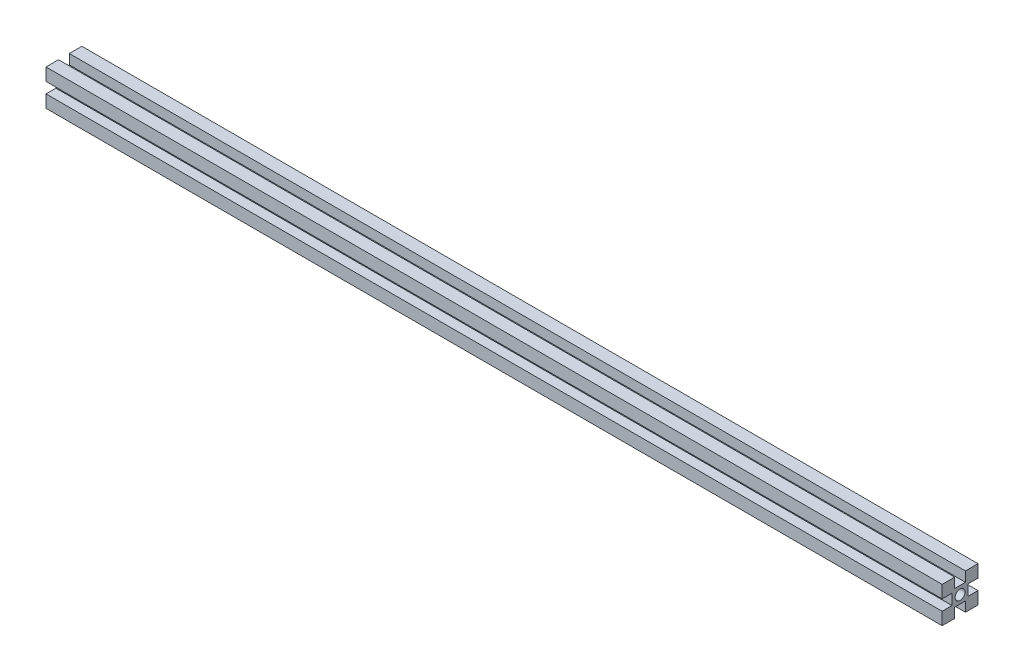
ISO-10303-21;
HEADER;
FILE_DESCRIPTION(('STEP AP214'),'2;1');
FILE_NAME('part.step','',(''),(''),'','','');
FILE_SCHEMA(('AUTOMOTIVE_DESIGN { 1 0 10303 214 1 1 1 1 }'));
ENDSEC;
DATA;
#1=APPLICATION_CONTEXT('core data for automotive mechanical design processes');
#2=APPLICATION_PROTOCOL_DEFINITION('international standard','automotive_design',2000,#1);
#3=PRODUCT_CONTEXT('',#1,'mechanical');
#4=PRODUCT('Part','Part','',(#3));
#5=PRODUCT_RELATED_PRODUCT_CATEGORY('part','',(#4));
#6=PRODUCT_DEFINITION_FORMATION('','',#4);
#7=PRODUCT_DEFINITION_CONTEXT('part definition',#1,'design');
#8=PRODUCT_DEFINITION('design','',#6,#7);
#9=PRODUCT_DEFINITION_SHAPE('','',#8);
#10=(LENGTH_UNIT() NAMED_UNIT(*) SI_UNIT(.MILLI.,.METRE.));
#11=(NAMED_UNIT(*) PLANE_ANGLE_UNIT() SI_UNIT($,.RADIAN.));
#12=(NAMED_UNIT(*) SI_UNIT($,.STERADIAN.) SOLID_ANGLE_UNIT());
#13=UNCERTAINTY_MEASURE_WITH_UNIT(LENGTH_MEASURE(1.E-05),#10,'distance_accuracy_value','');
#14=(GEOMETRIC_REPRESENTATION_CONTEXT(3) GLOBAL_UNCERTAINTY_ASSIGNED_CONTEXT((#13)) GLOBAL_UNIT_ASSIGNED_CONTEXT((#10,
#11,#12)) REPRESENTATION_CONTEXT('',''));
#15=CARTESIAN_POINT('',(0.,0.,0.));
#16=DIRECTION('',(0.,0.,1.));
#17=DIRECTION('',(1.,0.,0.));
#18=AXIS2_PLACEMENT_3D('',#15,#16,#17);
#19=CARTESIAN_POINT('',(500.,10.,-9.99999999999997));
#20=DIRECTION('',(0.,0.,-1.));
#21=DIRECTION('',(-1.,0.,0.));
#22=AXIS2_PLACEMENT_3D('',#19,#20,#21);
#23=PLANE('',#22);
#24=DIRECTION('',(0.,-1.,0.));
#25=VECTOR('',#24,1.);
#26=CARTESIAN_POINT('',(0.,10.,-10.));
#27=LINE('',#26,#25);
#28=CARTESIAN_POINT('',(0.,10.,-10.));
#29=VERTEX_POINT('',#28);
#30=CARTESIAN_POINT('',(0.,3.,-10.));
#31=VERTEX_POINT('',#30);
#32=EDGE_CURVE('E202',#29,#31,#27,.T.);
#33=ORIENTED_EDGE('',*,*,#32,.F.);
#34=DIRECTION('',(-1.,0.,0.));
#35=VECTOR('',#34,1.);
#36=CARTESIAN_POINT('',(500.,10.,-9.99999999999997));
#37=LINE('',#36,#35);
#38=CARTESIAN_POINT('',(500.,10.,-9.99999999999997));
#39=VERTEX_POINT('',#38);
#40=EDGE_CURVE('E11',#39,#29,#37,.T.);
#41=ORIENTED_EDGE('',*,*,#40,.F.);
#42=DIRECTION('',(0.,-1.,0.));
#43=VECTOR('',#42,1.);
#44=CARTESIAN_POINT('',(500.,10.,-9.99999999999997));
#45=LINE('',#44,#43);
#46=CARTESIAN_POINT('',(500.,3.,-9.99999999999997));
#47=VERTEX_POINT('',#46);
#48=EDGE_CURVE('E259',#39,#47,#45,.T.);
#49=ORIENTED_EDGE('',*,*,#48,.T.);
#50=DIRECTION('',(-1.,0.,0.));
#51=VECTOR('',#50,1.);
#52=CARTESIAN_POINT('',(500.,3.,-9.99999999999997));
#53=LINE('',#52,#51);
#54=EDGE_CURVE('E36',#47,#31,#53,.T.);
#55=ORIENTED_EDGE('',*,*,#54,.T.);
#56=EDGE_LOOP('',(#33,#41,#49,#55));
#57=FACE_BOUND('',#56,.T.);
#58=ADVANCED_FACE('F33',(#57),#23,.T.);
#59=CARTESIAN_POINT('',(500.,10.,-2.99999999999997));
#60=DIRECTION('',(0.,1.,0.));
#61=DIRECTION('',(0.,0.,1.));
#62=AXIS2_PLACEMENT_3D('',#59,#60,#61);
#63=PLANE('',#62);
#64=DIRECTION('',(0.,0.,-1.));
#65=VECTOR('',#64,1.);
#66=CARTESIAN_POINT('',(0.,10.,-3.));
#67=LINE('',#66,#65);
#68=CARTESIAN_POINT('',(0.,10.,-3.));
#69=VERTEX_POINT('',#68);
#70=EDGE_CURVE('E257',#69,#29,#67,.T.);
#71=ORIENTED_EDGE('',*,*,#70,.F.);
#72=DIRECTION('',(-1.,0.,0.));
#73=VECTOR('',#72,1.);
#74=CARTESIAN_POINT('',(500.,10.,-2.99999999999997));
#75=LINE('',#74,#73);
#76=CARTESIAN_POINT('',(500.,10.,-2.99999999999997));
#77=VERTEX_POINT('',#76);
#78=EDGE_CURVE('E42',#77,#69,#75,.T.);
#79=ORIENTED_EDGE('',*,*,#78,.F.);
#80=DIRECTION('',(0.,0.,-1.));
#81=VECTOR('',#80,1.);
#82=CARTESIAN_POINT('',(500.,10.,-2.99999999999997));
#83=LINE('',#82,#81);
#84=EDGE_CURVE('E192',#77,#39,#83,.T.);
#85=ORIENTED_EDGE('',*,*,#84,.T.);
#86=ORIENTED_EDGE('',*,*,#40,.T.);
#87=EDGE_LOOP('',(#71,#79,#85,#86));
#88=FACE_BOUND('',#87,.T.);
#89=ADVANCED_FACE('F295',(#88),#63,.T.);
#90=CARTESIAN_POINT('',(500.,4.5,-2.99999999999997));
#91=DIRECTION('',(0.,0.,1.));
#92=DIRECTION('',(1.,0.,0.));
#93=AXIS2_PLACEMENT_3D('',#90,#91,#92);
#94=PLANE('',#93);
#95=DIRECTION('',(0.,1.,0.));
#96=VECTOR('',#95,1.);
#97=CARTESIAN_POINT('',(0.,4.5,-3.));
#98=LINE('',#97,#96);
#99=CARTESIAN_POINT('',(0.,4.5,-3.));
#100=VERTEX_POINT('',#99);
#101=EDGE_CURVE('E179',#100,#69,#98,.T.);
#102=ORIENTED_EDGE('',*,*,#101,.F.);
#103=DIRECTION('',(-1.,0.,0.));
#104=VECTOR('',#103,1.);
#105=CARTESIAN_POINT('',(500.,4.5,-2.99999999999997));
#106=LINE('',#105,#104);
#107=CARTESIAN_POINT('',(500.,4.5,-2.99999999999997));
#108=VERTEX_POINT('',#107);
#109=EDGE_CURVE('E174',#108,#100,#106,.T.);
#110=ORIENTED_EDGE('',*,*,#109,.F.);
#111=DIRECTION('',(0.,1.,0.));
#112=VECTOR('',#111,1.);
#113=CARTESIAN_POINT('',(500.,4.5,-2.99999999999997));
#114=LINE('',#113,#112);
#115=EDGE_CURVE('E177',#108,#77,#114,.T.);
#116=ORIENTED_EDGE('',*,*,#115,.T.);
#117=ORIENTED_EDGE('',*,*,#78,.T.);
#118=EDGE_LOOP('',(#102,#110,#116,#117));
#119=FACE_BOUND('',#118,.T.);
#120=ADVANCED_FACE('F176',(#119),#94,.T.);
#121=CARTESIAN_POINT('',(500.,4.5,3.00000000000003));
#122=DIRECTION('',(0.,1.,0.));
#123=DIRECTION('',(0.,0.,1.));
#124=AXIS2_PLACEMENT_3D('',#121,#122,#123);
#125=PLANE('',#124);
#126=DIRECTION('',(0.,0.,-1.));
#127=VECTOR('',#126,1.);
#128=CARTESIAN_POINT('',(0.,4.5,3.));
#129=LINE('',#128,#127);
#130=CARTESIAN_POINT('',(0.,4.5,3.));
#131=VERTEX_POINT('',#130);
#132=EDGE_CURVE('E254',#131,#100,#129,.T.);
#133=ORIENTED_EDGE('',*,*,#132,.F.);
#134=DIRECTION('',(-1.,0.,0.));
#135=VECTOR('',#134,1.);
#136=CARTESIAN_POINT('',(500.,4.5,3.00000000000003));
#137=LINE('',#136,#135);
#138=CARTESIAN_POINT('',(500.,4.5,3.00000000000003));
#139=VERTEX_POINT('',#138);
#140=EDGE_CURVE('E184',#139,#131,#137,.T.);
#141=ORIENTED_EDGE('',*,*,#140,.F.);
#142=DIRECTION('',(0.,0.,-1.));
#143=VECTOR('',#142,1.);
#144=CARTESIAN_POINT('',(500.,4.5,3.00000000000003));
#145=LINE('',#144,#143);
#146=EDGE_CURVE('E190',#139,#108,#145,.T.);
#147=ORIENTED_EDGE('',*,*,#146,.T.);
#148=ORIENTED_EDGE('',*,*,#109,.T.);
#149=EDGE_LOOP('',(#133,#141,#147,#148));
#150=FACE_BOUND('',#149,.T.);
#151=ADVANCED_FACE('F194',(#150),#125,.T.);
#152=CARTESIAN_POINT('',(500.,10.,3.00000000000003));
#153=DIRECTION('',(0.,0.,-1.));
#154=DIRECTION('',(-1.,0.,0.));
#155=AXIS2_PLACEMENT_3D('',#152,#153,#154);
#156=PLANE('',#155);
#157=DIRECTION('',(0.,-1.,0.));
#158=VECTOR('',#157,1.);
#159=CARTESIAN_POINT('',(0.,10.,3.));
#160=LINE('',#159,#158);
#161=CARTESIAN_POINT('',(0.,10.,3.));
#162=VERTEX_POINT('',#161);
#163=EDGE_CURVE('E251',#162,#131,#160,.T.);
#164=ORIENTED_EDGE('',*,*,#163,.F.);
#165=DIRECTION('',(-1.,0.,0.));
#166=VECTOR('',#165,1.);
#167=CARTESIAN_POINT('',(500.,10.,3.00000000000003));
#168=LINE('',#167,#166);
#169=CARTESIAN_POINT('',(500.,10.,3.00000000000003));
#170=VERTEX_POINT('',#169);
#171=EDGE_CURVE('E263',#170,#162,#168,.T.);
#172=ORIENTED_EDGE('',*,*,#171,.F.);
#173=DIRECTION('',(0.,-1.,0.));
#174=VECTOR('',#173,1.);
#175=CARTESIAN_POINT('',(500.,10.,3.00000000000003));
#176=LINE('',#175,#174);
#177=EDGE_CURVE('E195',#170,#139,#176,.T.);
#178=ORIENTED_EDGE('',*,*,#177,.T.);
#179=ORIENTED_EDGE('',*,*,#140,.T.);
#180=EDGE_LOOP('',(#164,#172,#178,#179));
#181=FACE_BOUND('',#180,.T.);
#182=ADVANCED_FACE('F308',(#181),#156,.T.);
#183=CARTESIAN_POINT('',(500.,10.,10.));
#184=DIRECTION('',(0.,1.,0.));
#185=DIRECTION('',(0.,0.,1.));
#186=AXIS2_PLACEMENT_3D('',#183,#184,#185);
#187=PLANE('',#186);
#188=DIRECTION('',(0.,0.,-1.));
#189=VECTOR('',#188,1.);
#190=CARTESIAN_POINT('',(0.,10.,10.));
#191=LINE('',#190,#189);
#192=CARTESIAN_POINT('',(0.,10.,10.));
#193=VERTEX_POINT('',#192);
#194=EDGE_CURVE('E248',#193,#162,#191,.T.);
#195=ORIENTED_EDGE('',*,*,#194,.F.);
#196=DIRECTION('',(-1.,0.,0.));
#197=VECTOR('',#196,1.);
#198=CARTESIAN_POINT('',(500.,10.,10.));
#199=LINE('',#198,#197);
#200=CARTESIAN_POINT('',(500.,10.,10.));
#201=VERTEX_POINT('',#200);
#202=EDGE_CURVE('E265',#201,#193,#199,.T.);
#203=ORIENTED_EDGE('',*,*,#202,.F.);
#204=DIRECTION('',(0.,0.,-1.));
#205=VECTOR('',#204,1.);
#206=CARTESIAN_POINT('',(500.,10.,10.));
#207=LINE('',#206,#205);
#208=EDGE_CURVE('E197',#201,#170,#207,.T.);
#209=ORIENTED_EDGE('',*,*,#208,.T.);
#210=ORIENTED_EDGE('',*,*,#171,.T.);
#211=EDGE_LOOP('',(#195,#203,#209,#210));
#212=FACE_BOUND('',#211,.T.);
#213=ADVANCED_FACE('F311',(#212),#187,.T.);
#214=CARTESIAN_POINT('',(500.,3.,10.));
#215=DIRECTION('',(0.,0.,1.));
#216=DIRECTION('',(1.,0.,0.));
#217=AXIS2_PLACEMENT_3D('',#214,#215,#216);
#218=PLANE('',#217);
#219=DIRECTION('',(0.,1.,0.));
#220=VECTOR('',#219,1.);
#221=CARTESIAN_POINT('',(0.,3.,10.));
#222=LINE('',#221,#220);
#223=CARTESIAN_POINT('',(0.,3.,10.));
#224=VERTEX_POINT('',#223);
#225=EDGE_CURVE('E245',#224,#193,#222,.T.);
#226=ORIENTED_EDGE('',*,*,#225,.F.);
#227=DIRECTION('',(-1.,0.,0.));
#228=VECTOR('',#227,1.);
#229=CARTESIAN_POINT('',(500.,3.,10.));
#230=LINE('',#229,#228);
#231=CARTESIAN_POINT('',(500.,3.,10.));
#232=VERTEX_POINT('',#231);
#233=EDGE_CURVE('E267',#232,#224,#230,.T.);
#234=ORIENTED_EDGE('',*,*,#233,.F.);
#235=DIRECTION('',(0.,1.,0.));
#236=VECTOR('',#235,1.);
#237=CARTESIAN_POINT('',(500.,3.,10.));
#238=LINE('',#237,#236);
#239=EDGE_CURVE('E430',#232,#201,#238,.T.);
#240=ORIENTED_EDGE('',*,*,#239,.T.);
#241=ORIENTED_EDGE('',*,*,#202,.T.);
#242=EDGE_LOOP('',(#226,#234,#240,#241));
#243=FACE_BOUND('',#242,.T.);
#244=ADVANCED_FACE('F315',(#243),#218,.T.);
#245=CARTESIAN_POINT('',(500.,3.,4.50000000000003));
#246=DIRECTION('',(0.,-1.,0.));
#247=DIRECTION('',(0.,0.,-1.));
#248=AXIS2_PLACEMENT_3D('',#245,#246,#247);
#249=PLANE('',#248);
#250=DIRECTION('',(0.,0.,1.));
#251=VECTOR('',#250,1.);
#252=CARTESIAN_POINT('',(0.,3.,4.5));
#253=LINE('',#252,#251);
#254=CARTESIAN_POINT('',(0.,3.,4.5));
#255=VERTEX_POINT('',#254);
#256=EDGE_CURVE('E242',#255,#224,#253,.T.);
#257=ORIENTED_EDGE('',*,*,#256,.F.);
#258=DIRECTION('',(-1.,0.,0.));
#259=VECTOR('',#258,1.);
#260=CARTESIAN_POINT('',(500.,3.,4.50000000000003));
#261=LINE('',#260,#259);
#262=CARTESIAN_POINT('',(500.,3.,4.50000000000003));
#263=VERTEX_POINT('',#262);
#264=EDGE_CURVE('E269',#263,#255,#261,.T.);
#265=ORIENTED_EDGE('',*,*,#264,.F.);
#266=DIRECTION('',(0.,0.,1.));
#267=VECTOR('',#266,1.);
#268=CARTESIAN_POINT('',(500.,3.,4.50000000000003));
#269=LINE('',#268,#267);
#270=EDGE_CURVE('E427',#263,#232,#269,.T.);
#271=ORIENTED_EDGE('',*,*,#270,.T.);
#272=ORIENTED_EDGE('',*,*,#233,.T.);
#273=EDGE_LOOP('',(#257,#265,#271,#272));
#274=FACE_BOUND('',#273,.T.);
#275=ADVANCED_FACE('F319',(#274),#249,.T.);
#276=CARTESIAN_POINT('',(500.,-3.,4.50000000000003));
#277=DIRECTION('',(0.,0.,1.));
#278=DIRECTION('',(1.,0.,0.));
#279=AXIS2_PLACEMENT_3D('',#276,#277,#278);
#280=PLANE('',#279);
#281=DIRECTION('',(0.,1.,0.));
#282=VECTOR('',#281,1.);
#283=CARTESIAN_POINT('',(0.,-3.,4.5));
#284=LINE('',#283,#282);
#285=CARTESIAN_POINT('',(0.,-3.,4.5));
#286=VERTEX_POINT('',#285);
#287=EDGE_CURVE('E239',#286,#255,#284,.T.);
#288=ORIENTED_EDGE('',*,*,#287,.F.);
#289=DIRECTION('',(-1.,0.,0.));
#290=VECTOR('',#289,1.);
#291=CARTESIAN_POINT('',(500.,-3.,4.50000000000003));
#292=LINE('',#291,#290);
#293=CARTESIAN_POINT('',(500.,-3.,4.50000000000003));
#294=VERTEX_POINT('',#293);
#295=EDGE_CURVE('E271',#294,#286,#292,.T.);
#296=ORIENTED_EDGE('',*,*,#295,.F.);
#297=DIRECTION('',(0.,1.,0.));
#298=VECTOR('',#297,1.);
#299=CARTESIAN_POINT('',(500.,-3.,4.50000000000003));
#300=LINE('',#299,#298);
#301=EDGE_CURVE('E424',#294,#263,#300,.T.);
#302=ORIENTED_EDGE('',*,*,#301,.T.);
#303=ORIENTED_EDGE('',*,*,#264,.T.);
#304=EDGE_LOOP('',(#288,#296,#302,#303));
#305=FACE_BOUND('',#304,.T.);
#306=ADVANCED_FACE('F323',(#305),#280,.T.);
#307=CARTESIAN_POINT('',(500.,-3.,10.));
#308=DIRECTION('',(0.,1.,0.));
#309=DIRECTION('',(0.,0.,1.));
#310=AXIS2_PLACEMENT_3D('',#307,#308,#309);
#311=PLANE('',#310);
#312=DIRECTION('',(0.,0.,-1.));
#313=VECTOR('',#312,1.);
#314=CARTESIAN_POINT('',(0.,-3.,10.));
#315=LINE('',#314,#313);
#316=CARTESIAN_POINT('',(0.,-3.,10.));
#317=VERTEX_POINT('',#316);
#318=EDGE_CURVE('E236',#317,#286,#315,.T.);
#319=ORIENTED_EDGE('',*,*,#318,.F.);
#320=DIRECTION('',(-1.,0.,0.));
#321=VECTOR('',#320,1.);
#322=CARTESIAN_POINT('',(500.,-3.,10.));
#323=LINE('',#322,#321);
#324=CARTESIAN_POINT('',(500.,-3.,10.));
#325=VERTEX_POINT('',#324);
#326=EDGE_CURVE('E273',#325,#317,#323,.T.);
#327=ORIENTED_EDGE('',*,*,#326,.F.);
#328=DIRECTION('',(0.,0.,-1.));
#329=VECTOR('',#328,1.);
#330=CARTESIAN_POINT('',(500.,-3.,10.));
#331=LINE('',#330,#329);
#332=EDGE_CURVE('E421',#325,#294,#331,.T.);
#333=ORIENTED_EDGE('',*,*,#332,.T.);
#334=ORIENTED_EDGE('',*,*,#295,.T.);
#335=EDGE_LOOP('',(#319,#327,#333,#334));
#336=FACE_BOUND('',#335,.T.);
#337=ADVANCED_FACE('F327',(#336),#311,.T.);
#338=CARTESIAN_POINT('',(500.,-10.,10.));
#339=DIRECTION('',(0.,0.,1.));
#340=DIRECTION('',(1.,0.,0.));
#341=AXIS2_PLACEMENT_3D('',#338,#339,#340);
#342=PLANE('',#341);
#343=DIRECTION('',(0.,1.,0.));
#344=VECTOR('',#343,1.);
#345=CARTESIAN_POINT('',(0.,-10.,10.));
#346=LINE('',#345,#344);
#347=CARTESIAN_POINT('',(0.,-10.,10.));
#348=VERTEX_POINT('',#347);
#349=EDGE_CURVE('E233',#348,#317,#346,.T.);
#350=ORIENTED_EDGE('',*,*,#349,.F.);
#351=DIRECTION('',(-1.,0.,0.));
#352=VECTOR('',#351,1.);
#353=CARTESIAN_POINT('',(500.,-10.,10.));
#354=LINE('',#353,#352);
#355=CARTESIAN_POINT('',(500.,-10.,10.));
#356=VERTEX_POINT('',#355);
#357=EDGE_CURVE('E275',#356,#348,#354,.T.);
#358=ORIENTED_EDGE('',*,*,#357,.F.);
#359=DIRECTION('',(0.,1.,0.));
#360=VECTOR('',#359,1.);
#361=CARTESIAN_POINT('',(500.,-10.,10.));
#362=LINE('',#361,#360);
#363=EDGE_CURVE('E418',#356,#325,#362,.T.);
#364=ORIENTED_EDGE('',*,*,#363,.T.);
#365=ORIENTED_EDGE('',*,*,#326,.T.);
#366=EDGE_LOOP('',(#350,#358,#364,#365));
#367=FACE_BOUND('',#366,.T.);
#368=ADVANCED_FACE('F331',(#367),#342,.T.);
#369=CARTESIAN_POINT('',(500.,-10.,3.00000000000003));
#370=DIRECTION('',(0.,-1.,0.));
#371=DIRECTION('',(0.,0.,-1.));
#372=AXIS2_PLACEMENT_3D('',#369,#370,#371);
#373=PLANE('',#372);
#374=DIRECTION('',(0.,0.,1.));
#375=VECTOR('',#374,1.);
#376=CARTESIAN_POINT('',(0.,-10.,3.));
#377=LINE('',#376,#375);
#378=CARTESIAN_POINT('',(0.,-10.,3.));
#379=VERTEX_POINT('',#378);
#380=EDGE_CURVE('E230',#379,#348,#377,.T.);
#381=ORIENTED_EDGE('',*,*,#380,.F.);
#382=DIRECTION('',(-1.,0.,0.));
#383=VECTOR('',#382,1.);
#384=CARTESIAN_POINT('',(500.,-10.,3.00000000000003));
#385=LINE('',#384,#383);
#386=CARTESIAN_POINT('',(500.,-10.,3.00000000000003));
#387=VERTEX_POINT('',#386);
#388=EDGE_CURVE('E277',#387,#379,#385,.T.);
#389=ORIENTED_EDGE('',*,*,#388,.F.);
#390=DIRECTION('',(0.,0.,1.));
#391=VECTOR('',#390,1.);
#392=CARTESIAN_POINT('',(500.,-10.,3.00000000000003));
#393=LINE('',#392,#391);
#394=EDGE_CURVE('E415',#387,#356,#393,.T.);
#395=ORIENTED_EDGE('',*,*,#394,.T.);
#396=ORIENTED_EDGE('',*,*,#357,.T.);
#397=EDGE_LOOP('',(#381,#389,#395,#396));
#398=FACE_BOUND('',#397,.T.);
#399=ADVANCED_FACE('F335',(#398),#373,.T.);
#400=CARTESIAN_POINT('',(500.,-4.5,3.00000000000003));
#401=DIRECTION('',(0.,0.,-1.));
#402=DIRECTION('',(-1.,0.,0.));
#403=AXIS2_PLACEMENT_3D('',#400,#401,#402);
#404=PLANE('',#403);
#405=DIRECTION('',(0.,-1.,0.));
#406=VECTOR('',#405,1.);
#407=CARTESIAN_POINT('',(0.,-4.5,3.));
#408=LINE('',#407,#406);
#409=CARTESIAN_POINT('',(0.,-4.5,3.));
#410=VERTEX_POINT('',#409);
#411=EDGE_CURVE('E227',#410,#379,#408,.T.);
#412=ORIENTED_EDGE('',*,*,#411,.F.);
#413=DIRECTION('',(-1.,0.,0.));
#414=VECTOR('',#413,1.);
#415=CARTESIAN_POINT('',(500.,-4.5,3.00000000000003));
#416=LINE('',#415,#414);
#417=CARTESIAN_POINT('',(500.,-4.5,3.00000000000003));
#418=VERTEX_POINT('',#417);
#419=EDGE_CURVE('E279',#418,#410,#416,.T.);
#420=ORIENTED_EDGE('',*,*,#419,.F.);
#421=DIRECTION('',(0.,-1.,0.));
#422=VECTOR('',#421,1.);
#423=CARTESIAN_POINT('',(500.,-4.5,3.00000000000003));
#424=LINE('',#423,#422);
#425=EDGE_CURVE('E412',#418,#387,#424,.T.);
#426=ORIENTED_EDGE('',*,*,#425,.T.);
#427=ORIENTED_EDGE('',*,*,#388,.T.);
#428=EDGE_LOOP('',(#412,#420,#426,#427));
#429=FACE_BOUND('',#428,.T.);
#430=ADVANCED_FACE('F339',(#429),#404,.T.);
#431=CARTESIAN_POINT('',(500.,-4.5,-2.99999999999997));
#432=DIRECTION('',(0.,-1.,0.));
#433=DIRECTION('',(0.,0.,-1.));
#434=AXIS2_PLACEMENT_3D('',#431,#432,#433);
#435=PLANE('',#434);
#436=DIRECTION('',(0.,0.,1.));
#437=VECTOR('',#436,1.);
#438=CARTESIAN_POINT('',(0.,-4.5,-3.));
#439=LINE('',#438,#437);
#440=CARTESIAN_POINT('',(0.,-4.5,-3.));
#441=VERTEX_POINT('',#440);
#442=EDGE_CURVE('E224',#441,#410,#439,.T.);
#443=ORIENTED_EDGE('',*,*,#442,.F.);
#444=DIRECTION('',(-1.,0.,0.));
#445=VECTOR('',#444,1.);
#446=CARTESIAN_POINT('',(500.,-4.5,-2.99999999999997));
#447=LINE('',#446,#445);
#448=CARTESIAN_POINT('',(500.,-4.5,-2.99999999999997));
#449=VERTEX_POINT('',#448);
#450=EDGE_CURVE('E281',#449,#441,#447,.T.);
#451=ORIENTED_EDGE('',*,*,#450,.F.);
#452=DIRECTION('',(0.,0.,1.));
#453=VECTOR('',#452,1.);
#454=CARTESIAN_POINT('',(500.,-4.5,-2.99999999999997));
#455=LINE('',#454,#453);
#456=EDGE_CURVE('E409',#449,#418,#455,.T.);
#457=ORIENTED_EDGE('',*,*,#456,.T.);
#458=ORIENTED_EDGE('',*,*,#419,.T.);
#459=EDGE_LOOP('',(#443,#451,#457,#458));
#460=FACE_BOUND('',#459,.T.);
#461=ADVANCED_FACE('F343',(#460),#435,.T.);
#462=CARTESIAN_POINT('',(500.,-10.,-2.99999999999997));
#463=DIRECTION('',(0.,0.,1.));
#464=DIRECTION('',(1.,0.,0.));
#465=AXIS2_PLACEMENT_3D('',#462,#463,#464);
#466=PLANE('',#465);
#467=DIRECTION('',(0.,1.,0.));
#468=VECTOR('',#467,1.);
#469=CARTESIAN_POINT('',(0.,-10.,-3.));
#470=LINE('',#469,#468);
#471=CARTESIAN_POINT('',(0.,-10.,-3.));
#472=VERTEX_POINT('',#471);
#473=EDGE_CURVE('E221',#472,#441,#470,.T.);
#474=ORIENTED_EDGE('',*,*,#473,.F.);
#475=DIRECTION('',(-1.,0.,0.));
#476=VECTOR('',#475,1.);
#477=CARTESIAN_POINT('',(500.,-10.,-2.99999999999997));
#478=LINE('',#477,#476);
#479=CARTESIAN_POINT('',(500.,-10.,-2.99999999999997));
#480=VERTEX_POINT('',#479);
#481=EDGE_CURVE('E283',#480,#472,#478,.T.);
#482=ORIENTED_EDGE('',*,*,#481,.F.);
#483=DIRECTION('',(0.,1.,0.));
#484=VECTOR('',#483,1.);
#485=CARTESIAN_POINT('',(500.,-10.,-2.99999999999997));
#486=LINE('',#485,#484);
#487=EDGE_CURVE('E406',#480,#449,#486,.T.);
#488=ORIENTED_EDGE('',*,*,#487,.T.);
#489=ORIENTED_EDGE('',*,*,#450,.T.);
#490=EDGE_LOOP('',(#474,#482,#488,#489));
#491=FACE_BOUND('',#490,.T.);
#492=ADVANCED_FACE('F347',(#491),#466,.T.);
#493=CARTESIAN_POINT('',(500.,-10.,-9.99999999999997));
#494=DIRECTION('',(0.,-1.,0.));
#495=DIRECTION('',(0.,0.,-1.));
#496=AXIS2_PLACEMENT_3D('',#493,#494,#495);
#497=PLANE('',#496);
#498=DIRECTION('',(0.,0.,1.));
#499=VECTOR('',#498,1.);
#500=CARTESIAN_POINT('',(0.,-10.,-10.));
#501=LINE('',#500,#499);
#502=CARTESIAN_POINT('',(0.,-10.,-10.));
#503=VERTEX_POINT('',#502);
#504=EDGE_CURVE('E218',#503,#472,#501,.T.);
#505=ORIENTED_EDGE('',*,*,#504,.F.);
#506=DIRECTION('',(-1.,0.,0.));
#507=VECTOR('',#506,1.);
#508=CARTESIAN_POINT('',(500.,-10.,-9.99999999999997));
#509=LINE('',#508,#507);
#510=CARTESIAN_POINT('',(500.,-10.,-9.99999999999997));
#511=VERTEX_POINT('',#510);
#512=EDGE_CURVE('E285',#511,#503,#509,.T.);
#513=ORIENTED_EDGE('',*,*,#512,.F.);
#514=DIRECTION('',(0.,0.,1.));
#515=VECTOR('',#514,1.);
#516=CARTESIAN_POINT('',(500.,-10.,-9.99999999999997));
#517=LINE('',#516,#515);
#518=EDGE_CURVE('E403',#511,#480,#517,.T.);
#519=ORIENTED_EDGE('',*,*,#518,.T.);
#520=ORIENTED_EDGE('',*,*,#481,.T.);
#521=EDGE_LOOP('',(#505,#513,#519,#520));
#522=FACE_BOUND('',#521,.T.);
#523=ADVANCED_FACE('F351',(#522),#497,.T.);
#524=CARTESIAN_POINT('',(500.,-3.,-9.99999999999997));
#525=DIRECTION('',(0.,0.,-1.));
#526=DIRECTION('',(-1.,0.,0.));
#527=AXIS2_PLACEMENT_3D('',#524,#525,#526);
#528=PLANE('',#527);
#529=DIRECTION('',(0.,-1.,0.));
#530=VECTOR('',#529,1.);
#531=CARTESIAN_POINT('',(0.,-3.,-10.));
#532=LINE('',#531,#530);
#533=CARTESIAN_POINT('',(0.,-3.,-10.));
#534=VERTEX_POINT('',#533);
#535=EDGE_CURVE('E215',#534,#503,#532,.T.);
#536=ORIENTED_EDGE('',*,*,#535,.F.);
#537=DIRECTION('',(-1.,0.,0.));
#538=VECTOR('',#537,1.);
#539=CARTESIAN_POINT('',(500.,-3.,-9.99999999999997));
#540=LINE('',#539,#538);
#541=CARTESIAN_POINT('',(500.,-3.,-9.99999999999997));
#542=VERTEX_POINT('',#541);
#543=EDGE_CURVE('E287',#542,#534,#540,.T.);
#544=ORIENTED_EDGE('',*,*,#543,.F.);
#545=DIRECTION('',(0.,-1.,0.));
#546=VECTOR('',#545,1.);
#547=CARTESIAN_POINT('',(500.,-3.,-9.99999999999997));
#548=LINE('',#547,#546);
#549=EDGE_CURVE('E400',#542,#511,#548,.T.);
#550=ORIENTED_EDGE('',*,*,#549,.T.);
#551=ORIENTED_EDGE('',*,*,#512,.T.);
#552=EDGE_LOOP('',(#536,#544,#550,#551));
#553=FACE_BOUND('',#552,.T.);
#554=ADVANCED_FACE('F355',(#553),#528,.T.);
#555=CARTESIAN_POINT('',(500.,-3.,-4.49999999999997));
#556=DIRECTION('',(0.,1.,0.));
#557=DIRECTION('',(0.,0.,1.));
#558=AXIS2_PLACEMENT_3D('',#555,#556,#557);
#559=PLANE('',#558);
#560=DIRECTION('',(0.,0.,-1.));
#561=VECTOR('',#560,1.);
#562=CARTESIAN_POINT('',(0.,-3.,-4.5));
#563=LINE('',#562,#561);
#564=CARTESIAN_POINT('',(0.,-3.,-4.5));
#565=VERTEX_POINT('',#564);
#566=EDGE_CURVE('E212',#565,#534,#563,.T.);
#567=ORIENTED_EDGE('',*,*,#566,.F.);
#568=DIRECTION('',(-1.,0.,0.));
#569=VECTOR('',#568,1.);
#570=CARTESIAN_POINT('',(500.,-3.,-4.49999999999997));
#571=LINE('',#570,#569);
#572=CARTESIAN_POINT('',(500.,-3.,-4.49999999999997));
#573=VERTEX_POINT('',#572);
#574=EDGE_CURVE('E289',#573,#565,#571,.T.);
#575=ORIENTED_EDGE('',*,*,#574,.F.);
#576=DIRECTION('',(0.,0.,-1.));
#577=VECTOR('',#576,1.);
#578=CARTESIAN_POINT('',(500.,-3.,-4.49999999999997));
#579=LINE('',#578,#577);
#580=EDGE_CURVE('E397',#573,#542,#579,.T.);
#581=ORIENTED_EDGE('',*,*,#580,.T.);
#582=ORIENTED_EDGE('',*,*,#543,.T.);
#583=EDGE_LOOP('',(#567,#575,#581,#582));
#584=FACE_BOUND('',#583,.T.);
#585=ADVANCED_FACE('F359',(#584),#559,.T.);
#586=CARTESIAN_POINT('',(500.,3.,-4.49999999999997));
#587=DIRECTION('',(0.,0.,-1.));
#588=DIRECTION('',(-1.,0.,0.));
#589=AXIS2_PLACEMENT_3D('',#586,#587,#588);
#590=PLANE('',#589);
#591=DIRECTION('',(0.,-1.,0.));
#592=VECTOR('',#591,1.);
#593=CARTESIAN_POINT('',(0.,3.,-4.5));
#594=LINE('',#593,#592);
#595=CARTESIAN_POINT('',(0.,3.,-4.5));
#596=VERTEX_POINT('',#595);
#597=EDGE_CURVE('E209',#596,#565,#594,.T.);
#598=ORIENTED_EDGE('',*,*,#597,.F.);
#599=DIRECTION('',(-1.,0.,0.));
#600=VECTOR('',#599,1.);
#601=CARTESIAN_POINT('',(500.,3.,-4.49999999999997));
#602=LINE('',#601,#600);
#603=CARTESIAN_POINT('',(500.,3.,-4.49999999999997));
#604=VERTEX_POINT('',#603);
#605=EDGE_CURVE('E290',#604,#596,#602,.T.);
#606=ORIENTED_EDGE('',*,*,#605,.F.);
#607=DIRECTION('',(0.,-1.,0.));
#608=VECTOR('',#607,1.);
#609=CARTESIAN_POINT('',(500.,3.,-4.49999999999997));
#610=LINE('',#609,#608);
#611=EDGE_CURVE('E394',#604,#573,#610,.T.);
#612=ORIENTED_EDGE('',*,*,#611,.T.);
#613=ORIENTED_EDGE('',*,*,#574,.T.);
#614=EDGE_LOOP('',(#598,#606,#612,#613));
#615=FACE_BOUND('',#614,.T.);
#616=ADVANCED_FACE('F363',(#615),#590,.T.);
#617=CARTESIAN_POINT('',(500.,3.,-9.99999999999997));
#618=DIRECTION('',(0.,-1.,0.));
#619=DIRECTION('',(0.,0.,-1.));
#620=AXIS2_PLACEMENT_3D('',#617,#618,#619);
#621=PLANE('',#620);
#622=DIRECTION('',(0.,0.,1.));
#623=VECTOR('',#622,1.);
#624=CARTESIAN_POINT('',(0.,3.,-10.));
#625=LINE('',#624,#623);
#626=EDGE_CURVE('E205',#31,#596,#625,.T.);
#627=ORIENTED_EDGE('',*,*,#626,.F.);
#628=ORIENTED_EDGE('',*,*,#54,.F.);
#629=DIRECTION('',(0.,0.,1.));
#630=VECTOR('',#629,1.);
#631=CARTESIAN_POINT('',(500.,3.,-9.99999999999997));
#632=LINE('',#631,#630);
#633=EDGE_CURVE('E392',#47,#604,#632,.T.);
#634=ORIENTED_EDGE('',*,*,#633,.T.);
#635=ORIENTED_EDGE('',*,*,#605,.T.);
#636=EDGE_LOOP('',(#627,#628,#634,#635));
#637=FACE_BOUND('',#636,.T.);
#638=ADVANCED_FACE('F292',(#637),#621,.T.);
#639=CARTESIAN_POINT('',(500.,0.,0.));
#640=DIRECTION('',(-1.,0.,0.));
#641=DIRECTION('',(0.,0.,1.));
#642=AXIS2_PLACEMENT_3D('',#639,#640,#641);
#643=PLANE('',#642);
#644=CARTESIAN_POINT('',(500.,0.,0.));
#645=DIRECTION('',(-1.,0.,0.));
#646=DIRECTION('',(0.,0.,-1.));
#647=AXIS2_PLACEMENT_3D('',#644,#645,#646);
#648=CIRCLE('',#647,2.75);
#649=CARTESIAN_POINT('',(500.,0.,-2.74999999999997));
#650=VERTEX_POINT('',#649);
#651=EDGE_CURVE('E206',#650,#650,#648,.T.);
#652=ORIENTED_EDGE('',*,*,#651,.T.);
#653=EDGE_LOOP('',(#652));
#654=FACE_BOUND('',#653,.T.);
#655=ORIENTED_EDGE('',*,*,#48,.F.);
#656=ORIENTED_EDGE('',*,*,#84,.F.);
#657=ORIENTED_EDGE('',*,*,#115,.F.);
#658=ORIENTED_EDGE('',*,*,#146,.F.);
#659=ORIENTED_EDGE('',*,*,#177,.F.);
#660=ORIENTED_EDGE('',*,*,#208,.F.);
#661=ORIENTED_EDGE('',*,*,#239,.F.);
#662=ORIENTED_EDGE('',*,*,#270,.F.);
#663=ORIENTED_EDGE('',*,*,#301,.F.);
#664=ORIENTED_EDGE('',*,*,#332,.F.);
#665=ORIENTED_EDGE('',*,*,#363,.F.);
#666=ORIENTED_EDGE('',*,*,#394,.F.);
#667=ORIENTED_EDGE('',*,*,#425,.F.);
#668=ORIENTED_EDGE('',*,*,#456,.F.);
#669=ORIENTED_EDGE('',*,*,#487,.F.);
#670=ORIENTED_EDGE('',*,*,#518,.F.);
#671=ORIENTED_EDGE('',*,*,#549,.F.);
#672=ORIENTED_EDGE('',*,*,#580,.F.);
#673=ORIENTED_EDGE('',*,*,#611,.F.);
#674=ORIENTED_EDGE('',*,*,#633,.F.);
#675=EDGE_LOOP('',(#655,#656,#657,#658,#659,#660,#661,#662,#663,#664,#665,#666,#667,#668,#669,
#670,#671,#672,#673,#674));
#676=FACE_BOUND('',#675,.T.);
#677=ADVANCED_FACE('F188',(#654,#676),#643,.F.);
#678=CARTESIAN_POINT('',(0.,0.,0.));
#679=DIRECTION('',(-1.,0.,0.));
#680=DIRECTION('',(0.,0.,1.));
#681=AXIS2_PLACEMENT_3D('',#678,#679,#680);
#682=PLANE('',#681);
#683=CARTESIAN_POINT('',(0.,0.,0.));
#684=DIRECTION('',(-1.,0.,0.));
#685=DIRECTION('',(0.,0.,-1.));
#686=AXIS2_PLACEMENT_3D('',#683,#684,#685);
#687=CIRCLE('',#686,2.75);
#688=CARTESIAN_POINT('',(0.,0.,-2.75));
#689=VERTEX_POINT('',#688);
#690=EDGE_CURVE('E387',#689,#689,#687,.T.);
#691=ORIENTED_EDGE('',*,*,#690,.F.);
#692=EDGE_LOOP('',(#691));
#693=FACE_BOUND('',#692,.T.);
#694=ORIENTED_EDGE('',*,*,#32,.T.);
#695=ORIENTED_EDGE('',*,*,#626,.T.);
#696=ORIENTED_EDGE('',*,*,#597,.T.);
#697=ORIENTED_EDGE('',*,*,#566,.T.);
#698=ORIENTED_EDGE('',*,*,#535,.T.);
#699=ORIENTED_EDGE('',*,*,#504,.T.);
#700=ORIENTED_EDGE('',*,*,#473,.T.);
#701=ORIENTED_EDGE('',*,*,#442,.T.);
#702=ORIENTED_EDGE('',*,*,#411,.T.);
#703=ORIENTED_EDGE('',*,*,#380,.T.);
#704=ORIENTED_EDGE('',*,*,#349,.T.);
#705=ORIENTED_EDGE('',*,*,#318,.T.);
#706=ORIENTED_EDGE('',*,*,#287,.T.);
#707=ORIENTED_EDGE('',*,*,#256,.T.);
#708=ORIENTED_EDGE('',*,*,#225,.T.);
#709=ORIENTED_EDGE('',*,*,#194,.T.);
#710=ORIENTED_EDGE('',*,*,#163,.T.);
#711=ORIENTED_EDGE('',*,*,#132,.T.);
#712=ORIENTED_EDGE('',*,*,#101,.T.);
#713=ORIENTED_EDGE('',*,*,#70,.T.);
#714=EDGE_LOOP('',(#694,#695,#696,#697,#698,#699,#700,#701,#702,#703,#704,#705,#706,#707,#708,
#709,#710,#711,#712,#713));
#715=FACE_BOUND('',#714,.T.);
#716=ADVANCED_FACE('F294',(#693,#715),#682,.T.);
#717=CARTESIAN_POINT('',(500.,0.,0.));
#718=DIRECTION('',(-1.,0.,0.));
#719=DIRECTION('',(0.,0.,1.));
#720=AXIS2_PLACEMENT_3D('',#717,#718,#719);
#721=CYLINDRICAL_SURFACE('',#720,2.75);
#722=ORIENTED_EDGE('',*,*,#651,.F.);
#723=EDGE_LOOP('',(#722));
#724=FACE_BOUND('',#723,.T.);
#725=ORIENTED_EDGE('',*,*,#690,.T.);
#726=EDGE_LOOP('',(#725));
#727=FACE_BOUND('',#726,.T.);
#728=ADVANCED_FACE('F375',(#724,#727),#721,.F.);
#729=CLOSED_SHELL('',(#58,#89,#120,#151,#182,#213,#244,#275,#306,#337,#368,#399,#430,#461,#492,
#523,#554,#585,#616,#638,#677,#716,#728));
#730=MANIFOLD_SOLID_BREP('B2',#729);
#731=ADVANCED_BREP_SHAPE_REPRESENTATION('',(#18,#730),#14);
#732=SHAPE_DEFINITION_REPRESENTATION(#9,#731);
ENDSEC;
END-ISO-10303-21;
